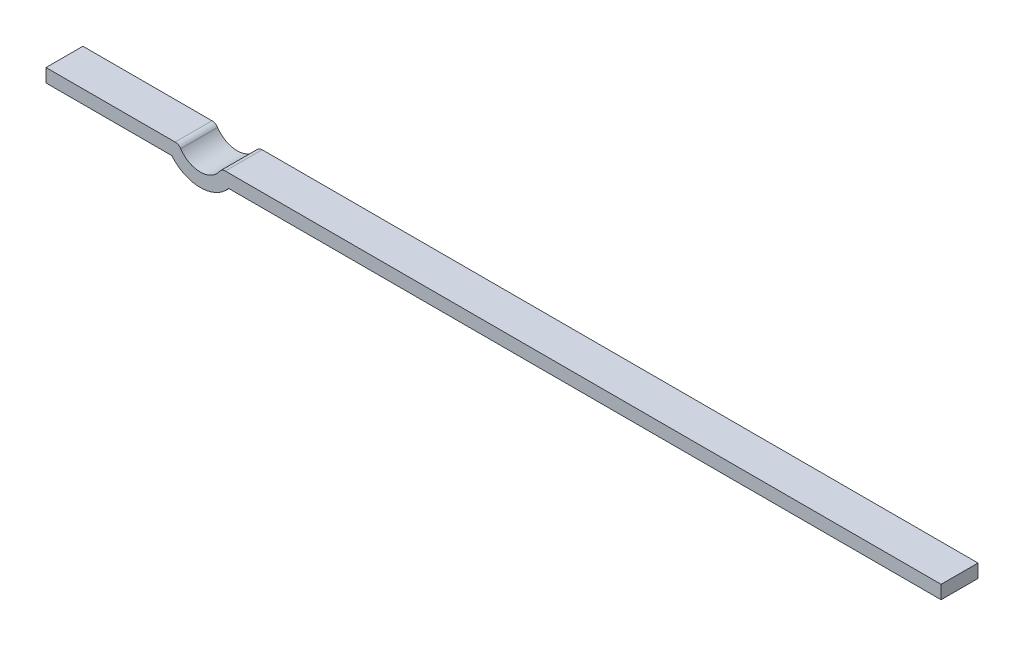
ISO-10303-21;
HEADER;
FILE_DESCRIPTION(('STEP AP214'),'2;1');
FILE_NAME('part.step','',(''),(''),'','','');
FILE_SCHEMA(('AUTOMOTIVE_DESIGN { 1 0 10303 214 1 1 1 1 }'));
ENDSEC;
DATA;
#1=APPLICATION_CONTEXT('core data for automotive mechanical design processes');
#2=APPLICATION_PROTOCOL_DEFINITION('international standard','automotive_design',2000,#1);
#3=PRODUCT_CONTEXT('',#1,'mechanical');
#4=PRODUCT('Part','Part','',(#3));
#5=PRODUCT_RELATED_PRODUCT_CATEGORY('part','',(#4));
#6=PRODUCT_DEFINITION_FORMATION('','',#4);
#7=PRODUCT_DEFINITION_CONTEXT('part definition',#1,'design');
#8=PRODUCT_DEFINITION('design','',#6,#7);
#9=PRODUCT_DEFINITION_SHAPE('','',#8);
#10=(LENGTH_UNIT() NAMED_UNIT(*) SI_UNIT(.MILLI.,.METRE.));
#11=(NAMED_UNIT(*) PLANE_ANGLE_UNIT() SI_UNIT($,.RADIAN.));
#12=(NAMED_UNIT(*) SI_UNIT($,.STERADIAN.) SOLID_ANGLE_UNIT());
#13=UNCERTAINTY_MEASURE_WITH_UNIT(LENGTH_MEASURE(1.E-05),#10,'distance_accuracy_value','');
#14=(GEOMETRIC_REPRESENTATION_CONTEXT(3) GLOBAL_UNCERTAINTY_ASSIGNED_CONTEXT((#13)) GLOBAL_UNIT_ASSIGNED_CONTEXT((#10,
#11,#12)) REPRESENTATION_CONTEXT('',''));
#15=CARTESIAN_POINT('',(0.,0.,0.));
#16=DIRECTION('',(0.,0.,1.));
#17=DIRECTION('',(1.,0.,0.));
#18=AXIS2_PLACEMENT_3D('',#15,#16,#17);
#19=CARTESIAN_POINT('',(6.675,-0.1,0.55));
#20=DIRECTION('',(-1.,0.,0.));
#21=DIRECTION('',(0.,0.,1.));
#22=AXIS2_PLACEMENT_3D('',#19,#20,#21);
#23=PLANE('',#22);
#24=DIRECTION('',(0.,1.,0.));
#25=VECTOR('',#24,1.);
#26=CARTESIAN_POINT('',(6.675,-0.1,0.));
#27=LINE('',#26,#25);
#28=CARTESIAN_POINT('',(6.675,-0.1,0.));
#29=VERTEX_POINT('',#28);
#30=CARTESIAN_POINT('',(6.675,0.1,0.));
#31=VERTEX_POINT('',#30);
#32=EDGE_CURVE('E142',#29,#31,#27,.T.);
#33=ORIENTED_EDGE('',*,*,#32,.T.);
#34=DIRECTION('',(0.,0.,-1.));
#35=VECTOR('',#34,1.);
#36=CARTESIAN_POINT('',(6.675,0.1,0.55));
#37=LINE('',#36,#35);
#38=CARTESIAN_POINT('',(6.675,0.1,0.55));
#39=VERTEX_POINT('',#38);
#40=EDGE_CURVE('E11',#39,#31,#37,.T.);
#41=ORIENTED_EDGE('',*,*,#40,.F.);
#42=DIRECTION('',(0.,1.,0.));
#43=VECTOR('',#42,1.);
#44=CARTESIAN_POINT('',(6.675,-0.1,0.55));
#45=LINE('',#44,#43);
#46=CARTESIAN_POINT('',(6.675,-0.1,0.55));
#47=VERTEX_POINT('',#46);
#48=EDGE_CURVE('E160',#47,#39,#45,.T.);
#49=ORIENTED_EDGE('',*,*,#48,.F.);
#50=DIRECTION('',(0.,0.,-1.));
#51=VECTOR('',#50,1.);
#52=CARTESIAN_POINT('',(6.675,-0.1,0.55));
#53=LINE('',#52,#51);
#54=EDGE_CURVE('E138',#47,#29,#53,.T.);
#55=ORIENTED_EDGE('',*,*,#54,.T.);
#56=EDGE_LOOP('',(#33,#41,#49,#55));
#57=FACE_BOUND('',#56,.T.);
#58=ADVANCED_FACE('F34',(#57),#23,.F.);
#59=CARTESIAN_POINT('',(-4.00059565600384,0.1,0.55));
#60=DIRECTION('',(0.,-1.,0.));
#61=DIRECTION('',(1.,0.,0.));
#62=AXIS2_PLACEMENT_3D('',#59,#60,#61);
#63=PLANE('',#62);
#64=DIRECTION('',(-1.,0.,0.));
#65=VECTOR('',#64,1.);
#66=CARTESIAN_POINT('',(-4.00059565600384,0.1,0.));
#67=LINE('',#66,#65);
#68=CARTESIAN_POINT('',(-4.00059565600384,0.1,0.));
#69=VERTEX_POINT('',#68);
#70=EDGE_CURVE('E145',#31,#69,#67,.T.);
#71=ORIENTED_EDGE('',*,*,#70,.T.);
#72=DIRECTION('',(0.,0.,-1.));
#73=VECTOR('',#72,1.);
#74=CARTESIAN_POINT('',(-4.00059565600384,0.1,0.55));
#75=LINE('',#74,#73);
#76=CARTESIAN_POINT('',(-4.00059565600384,0.1,0.55));
#77=VERTEX_POINT('',#76);
#78=EDGE_CURVE('E42',#77,#69,#75,.T.);
#79=ORIENTED_EDGE('',*,*,#78,.F.);
#80=DIRECTION('',(-1.,0.,0.));
#81=VECTOR('',#80,1.);
#82=CARTESIAN_POINT('',(-4.00059565600384,0.1,0.55));
#83=LINE('',#82,#81);
#84=EDGE_CURVE('E99',#39,#77,#83,.T.);
#85=ORIENTED_EDGE('',*,*,#84,.F.);
#86=ORIENTED_EDGE('',*,*,#40,.T.);
#87=EDGE_LOOP('',(#71,#79,#85,#86));
#88=FACE_BOUND('',#87,.T.);
#89=ADVANCED_FACE('F209',(#88),#63,.F.);
#90=CARTESIAN_POINT('',(-4.00059565600384,0.,0.55));
#91=DIRECTION('',(0.,0.,-1.));
#92=DIRECTION('',(-1.,0.,0.));
#93=AXIS2_PLACEMENT_3D('',#90,#91,#92);
#94=CYLINDRICAL_SURFACE('',#93,0.1);
#95=CARTESIAN_POINT('',(-4.00059565600384,0.,0.));
#96=DIRECTION('',(0.,0.,1.));
#97=DIRECTION('',(-1.,0.,0.));
#98=AXIS2_PLACEMENT_3D('',#95,#96,#97);
#99=CIRCLE('',#98,0.1);
#100=CARTESIAN_POINT('',(-4.08374106578076,0.0555593451457745,0.));
#101=VERTEX_POINT('',#100);
#102=EDGE_CURVE('E147',#69,#101,#99,.T.);
#103=ORIENTED_EDGE('',*,*,#102,.T.);
#104=DIRECTION('',(0.,0.,-1.));
#105=VECTOR('',#104,1.);
#106=CARTESIAN_POINT('',(-4.08374106578076,0.0555593451457745,0.55));
#107=LINE('',#106,#105);
#108=CARTESIAN_POINT('',(-4.08374106578076,0.0555593451457745,0.55));
#109=VERTEX_POINT('',#108);
#110=EDGE_CURVE('E173',#109,#101,#107,.T.);
#111=ORIENTED_EDGE('',*,*,#110,.F.);
#112=CARTESIAN_POINT('',(-4.00059565600384,0.,0.55));
#113=DIRECTION('',(0.,0.,1.));
#114=DIRECTION('',(-1.,0.,0.));
#115=AXIS2_PLACEMENT_3D('',#112,#113,#114);
#116=CIRCLE('',#115,0.1);
#117=EDGE_CURVE('E181',#77,#109,#116,.T.);
#118=ORIENTED_EDGE('',*,*,#117,.F.);
#119=ORIENTED_EDGE('',*,*,#78,.T.);
#120=EDGE_LOOP('',(#103,#111,#118,#119));
#121=FACE_BOUND('',#120,.T.);
#122=ADVANCED_FACE('F179',(#121),#94,.T.);
#123=CARTESIAN_POINT('',(-4.37475,0.250017053155985,0.55));
#124=DIRECTION('',(0.,0.,-1.));
#125=DIRECTION('',(-1.,0.,0.));
#126=AXIS2_PLACEMENT_3D('',#123,#124,#125);
#127=CYLINDRICAL_SURFACE('',#126,0.35);
#128=CARTESIAN_POINT('',(-4.37475,0.250017053155985,0.));
#129=DIRECTION('',(0.,0.,-1.));
#130=DIRECTION('',(1.,0.,0.));
#131=AXIS2_PLACEMENT_3D('',#128,#129,#130);
#132=CIRCLE('',#131,0.35);
#133=CARTESIAN_POINT('',(-4.66575893421924,0.0555593451457747,0.));
#134=VERTEX_POINT('',#133);
#135=EDGE_CURVE('E149',#101,#134,#132,.T.);
#136=ORIENTED_EDGE('',*,*,#135,.T.);
#137=DIRECTION('',(0.,0.,-1.));
#138=VECTOR('',#137,1.);
#139=CARTESIAN_POINT('',(-4.66575893421924,0.0555593451457747,0.55));
#140=LINE('',#139,#138);
#141=CARTESIAN_POINT('',(-4.66575893421924,0.0555593451457747,0.55));
#142=VERTEX_POINT('',#141);
#143=EDGE_CURVE('E170',#142,#134,#140,.T.);
#144=ORIENTED_EDGE('',*,*,#143,.F.);
#145=CARTESIAN_POINT('',(-4.37475,0.250017053155985,0.55));
#146=DIRECTION('',(0.,0.,-1.));
#147=DIRECTION('',(1.,0.,0.));
#148=AXIS2_PLACEMENT_3D('',#145,#146,#147);
#149=CIRCLE('',#148,0.35);
#150=EDGE_CURVE('E199',#109,#142,#149,.T.);
#151=ORIENTED_EDGE('',*,*,#150,.F.);
#152=ORIENTED_EDGE('',*,*,#110,.T.);
#153=EDGE_LOOP('',(#136,#144,#151,#152));
#154=FACE_BOUND('',#153,.T.);
#155=ADVANCED_FACE('F190',(#154),#127,.F.);
#156=CARTESIAN_POINT('',(-4.74890434399616,0.,0.55));
#157=DIRECTION('',(0.,0.,-1.));
#158=DIRECTION('',(-1.,0.,0.));
#159=AXIS2_PLACEMENT_3D('',#156,#157,#158);
#160=CYLINDRICAL_SURFACE('',#159,0.1);
#161=CARTESIAN_POINT('',(-4.74890434399616,0.,0.));
#162=DIRECTION('',(0.,0.,1.));
#163=DIRECTION('',(1.,0.,0.));
#164=AXIS2_PLACEMENT_3D('',#161,#162,#163);
#165=CIRCLE('',#164,0.1);
#166=CARTESIAN_POINT('',(-4.74890434399616,0.1,0.));
#167=VERTEX_POINT('',#166);
#168=EDGE_CURVE('E151',#134,#167,#165,.T.);
#169=ORIENTED_EDGE('',*,*,#168,.T.);
#170=DIRECTION('',(0.,0.,-1.));
#171=VECTOR('',#170,1.);
#172=CARTESIAN_POINT('',(-4.74890434399616,0.1,0.55));
#173=LINE('',#172,#171);
#174=CARTESIAN_POINT('',(-4.74890434399616,0.1,0.55));
#175=VERTEX_POINT('',#174);
#176=EDGE_CURVE('E167',#175,#167,#173,.T.);
#177=ORIENTED_EDGE('',*,*,#176,.F.);
#178=CARTESIAN_POINT('',(-4.74890434399616,0.,0.55));
#179=DIRECTION('',(0.,0.,1.));
#180=DIRECTION('',(1.,0.,0.));
#181=AXIS2_PLACEMENT_3D('',#178,#179,#180);
#182=CIRCLE('',#181,0.1);
#183=EDGE_CURVE('E196',#142,#175,#182,.T.);
#184=ORIENTED_EDGE('',*,*,#183,.F.);
#185=ORIENTED_EDGE('',*,*,#143,.T.);
#186=EDGE_LOOP('',(#169,#177,#184,#185));
#187=FACE_BOUND('',#186,.T.);
#188=ADVANCED_FACE('F194',(#187),#160,.T.);
#189=CARTESIAN_POINT('',(-6.675,0.1,0.55));
#190=DIRECTION('',(0.,-1.,0.));
#191=DIRECTION('',(1.,0.,0.));
#192=AXIS2_PLACEMENT_3D('',#189,#190,#191);
#193=PLANE('',#192);
#194=DIRECTION('',(-1.,0.,0.));
#195=VECTOR('',#194,1.);
#196=CARTESIAN_POINT('',(-6.675,0.1,0.));
#197=LINE('',#196,#195);
#198=CARTESIAN_POINT('',(-6.675,0.1,0.));
#199=VERTEX_POINT('',#198);
#200=EDGE_CURVE('E153',#167,#199,#197,.T.);
#201=ORIENTED_EDGE('',*,*,#200,.T.);
#202=DIRECTION('',(0.,0.,-1.));
#203=VECTOR('',#202,1.);
#204=CARTESIAN_POINT('',(-6.675,0.1,0.55));
#205=LINE('',#204,#203);
#206=CARTESIAN_POINT('',(-6.675,0.1,0.55));
#207=VERTEX_POINT('',#206);
#208=EDGE_CURVE('E164',#207,#199,#205,.T.);
#209=ORIENTED_EDGE('',*,*,#208,.F.);
#210=DIRECTION('',(-1.,0.,0.));
#211=VECTOR('',#210,1.);
#212=CARTESIAN_POINT('',(-6.675,0.1,0.55));
#213=LINE('',#212,#211);
#214=EDGE_CURVE('E198',#175,#207,#213,.T.);
#215=ORIENTED_EDGE('',*,*,#214,.F.);
#216=ORIENTED_EDGE('',*,*,#176,.T.);
#217=EDGE_LOOP('',(#201,#209,#215,#216));
#218=FACE_BOUND('',#217,.T.);
#219=ADVANCED_FACE('F221',(#218),#193,.F.);
#220=CARTESIAN_POINT('',(-6.675,-0.1,0.55));
#221=DIRECTION('',(1.,0.,0.));
#222=DIRECTION('',(0.,0.,-1.));
#223=AXIS2_PLACEMENT_3D('',#220,#221,#222);
#224=PLANE('',#223);
#225=DIRECTION('',(0.,-1.,0.));
#226=VECTOR('',#225,1.);
#227=CARTESIAN_POINT('',(-6.675,-0.1,0.));
#228=LINE('',#227,#226);
#229=CARTESIAN_POINT('',(-6.675,-0.1,0.));
#230=VERTEX_POINT('',#229);
#231=EDGE_CURVE('E155',#199,#230,#228,.T.);
#232=ORIENTED_EDGE('',*,*,#231,.T.);
#233=DIRECTION('',(0.,0.,-1.));
#234=VECTOR('',#233,1.);
#235=CARTESIAN_POINT('',(-6.675,-0.1,0.55));
#236=LINE('',#235,#234);
#237=CARTESIAN_POINT('',(-6.675,-0.1,0.55));
#238=VERTEX_POINT('',#237);
#239=EDGE_CURVE('E133',#238,#230,#236,.T.);
#240=ORIENTED_EDGE('',*,*,#239,.F.);
#241=DIRECTION('',(0.,-1.,0.));
#242=VECTOR('',#241,1.);
#243=CARTESIAN_POINT('',(-6.675,-0.1,0.55));
#244=LINE('',#243,#242);
#245=EDGE_CURVE('E124',#207,#238,#244,.T.);
#246=ORIENTED_EDGE('',*,*,#245,.F.);
#247=ORIENTED_EDGE('',*,*,#208,.T.);
#248=EDGE_LOOP('',(#232,#240,#246,#247));
#249=FACE_BOUND('',#248,.T.);
#250=ADVANCED_FACE('F224',(#249),#224,.F.);
#251=CARTESIAN_POINT('',(-6.675,-0.1,0.55));
#252=DIRECTION('',(0.,1.,0.));
#253=DIRECTION('',(0.,0.,1.));
#254=AXIS2_PLACEMENT_3D('',#251,#252,#253);
#255=PLANE('',#254);
#256=DIRECTION('',(1.,0.,0.));
#257=VECTOR('',#256,1.);
#258=CARTESIAN_POINT('',(-6.675,-0.1,0.));
#259=LINE('',#258,#257);
#260=CARTESIAN_POINT('',(-4.799,-0.1,0.));
#261=VERTEX_POINT('',#260);
#262=EDGE_CURVE('E132',#230,#261,#259,.T.);
#263=ORIENTED_EDGE('',*,*,#262,.T.);
#264=DIRECTION('',(0.,0.,-1.));
#265=VECTOR('',#264,1.);
#266=CARTESIAN_POINT('',(-4.799,-0.1,0.55));
#267=LINE('',#266,#265);
#268=CARTESIAN_POINT('',(-4.799,-0.1,0.55));
#269=VERTEX_POINT('',#268);
#270=EDGE_CURVE('E129',#269,#261,#267,.T.);
#271=ORIENTED_EDGE('',*,*,#270,.F.);
#272=DIRECTION('',(1.,0.,0.));
#273=VECTOR('',#272,1.);
#274=CARTESIAN_POINT('',(-6.675,-0.1,0.55));
#275=LINE('',#274,#273);
#276=EDGE_CURVE('E118',#238,#269,#275,.T.);
#277=ORIENTED_EDGE('',*,*,#276,.F.);
#278=ORIENTED_EDGE('',*,*,#239,.T.);
#279=EDGE_LOOP('',(#263,#271,#277,#278));
#280=FACE_BOUND('',#279,.T.);
#281=ADVANCED_FACE('F130',(#280),#255,.F.);
#282=CARTESIAN_POINT('',(-4.37475,0.250017053155985,0.55));
#283=DIRECTION('',(0.,0.,-1.));
#284=DIRECTION('',(-1.,0.,0.));
#285=AXIS2_PLACEMENT_3D('',#282,#283,#284);
#286=CYLINDRICAL_SURFACE('',#285,0.55);
#287=CARTESIAN_POINT('',(-4.37475,0.250017053155985,0.));
#288=DIRECTION('',(0.,0.,1.));
#289=DIRECTION('',(-1.,0.,0.));
#290=AXIS2_PLACEMENT_3D('',#287,#288,#289);
#291=CIRCLE('',#290,0.55);
#292=CARTESIAN_POINT('',(-3.9505,-0.0999999999999999,0.));
#293=VERTEX_POINT('',#292);
#294=EDGE_CURVE('E85',#261,#293,#291,.T.);
#295=ORIENTED_EDGE('',*,*,#294,.T.);
#296=DIRECTION('',(0.,0.,-1.));
#297=VECTOR('',#296,1.);
#298=CARTESIAN_POINT('',(-3.9505,-0.0999999999999999,0.55));
#299=LINE('',#298,#297);
#300=CARTESIAN_POINT('',(-3.9505,-0.0999999999999999,0.55));
#301=VERTEX_POINT('',#300);
#302=EDGE_CURVE('E134',#301,#293,#299,.T.);
#303=ORIENTED_EDGE('',*,*,#302,.F.);
#304=CARTESIAN_POINT('',(-4.37475,0.250017053155985,0.55));
#305=DIRECTION('',(0.,0.,1.));
#306=DIRECTION('',(-1.,0.,0.));
#307=AXIS2_PLACEMENT_3D('',#304,#305,#306);
#308=CIRCLE('',#307,0.55);
#309=EDGE_CURVE('E122',#269,#301,#308,.T.);
#310=ORIENTED_EDGE('',*,*,#309,.F.);
#311=ORIENTED_EDGE('',*,*,#270,.T.);
#312=EDGE_LOOP('',(#295,#303,#310,#311));
#313=FACE_BOUND('',#312,.T.);
#314=ADVANCED_FACE('F136',(#313),#286,.T.);
#315=CARTESIAN_POINT('',(-3.9505,-0.1,0.55));
#316=DIRECTION('',(0.,1.,0.));
#317=DIRECTION('',(0.,0.,1.));
#318=AXIS2_PLACEMENT_3D('',#315,#316,#317);
#319=PLANE('',#318);
#320=DIRECTION('',(1.,0.,0.));
#321=VECTOR('',#320,1.);
#322=CARTESIAN_POINT('',(-3.9505,-0.1,0.));
#323=LINE('',#322,#321);
#324=EDGE_CURVE('E91',#293,#29,#323,.T.);
#325=ORIENTED_EDGE('',*,*,#324,.T.);
#326=ORIENTED_EDGE('',*,*,#54,.F.);
#327=DIRECTION('',(1.,0.,0.));
#328=VECTOR('',#327,1.);
#329=CARTESIAN_POINT('',(-3.9505,-0.1,0.55));
#330=LINE('',#329,#328);
#331=EDGE_CURVE('E50',#301,#47,#330,.T.);
#332=ORIENTED_EDGE('',*,*,#331,.F.);
#333=ORIENTED_EDGE('',*,*,#302,.T.);
#334=EDGE_LOOP('',(#325,#326,#332,#333));
#335=FACE_BOUND('',#334,.T.);
#336=ADVANCED_FACE('F233',(#335),#319,.F.);
#337=CARTESIAN_POINT('',(-4.00059565600384,0.,0.55));
#338=DIRECTION('',(0.,0.,-1.));
#339=DIRECTION('',(-1.,0.,0.));
#340=AXIS2_PLACEMENT_3D('',#337,#338,#339);
#341=PLANE('',#340);
#342=ORIENTED_EDGE('',*,*,#48,.T.);
#343=ORIENTED_EDGE('',*,*,#84,.T.);
#344=ORIENTED_EDGE('',*,*,#117,.T.);
#345=ORIENTED_EDGE('',*,*,#150,.T.);
#346=ORIENTED_EDGE('',*,*,#183,.T.);
#347=ORIENTED_EDGE('',*,*,#214,.T.);
#348=ORIENTED_EDGE('',*,*,#245,.T.);
#349=ORIENTED_EDGE('',*,*,#276,.T.);
#350=ORIENTED_EDGE('',*,*,#309,.T.);
#351=ORIENTED_EDGE('',*,*,#331,.T.);
#352=EDGE_LOOP('',(#342,#343,#344,#345,#346,#347,#348,#349,#350,#351));
#353=FACE_BOUND('',#352,.T.);
#354=ADVANCED_FACE('F120',(#353),#341,.F.);
#355=CARTESIAN_POINT('',(-4.00059565600384,0.,0.));
#356=DIRECTION('',(0.,0.,-1.));
#357=DIRECTION('',(-1.,0.,0.));
#358=AXIS2_PLACEMENT_3D('',#355,#356,#357);
#359=PLANE('',#358);
#360=ORIENTED_EDGE('',*,*,#32,.F.);
#361=ORIENTED_EDGE('',*,*,#324,.F.);
#362=ORIENTED_EDGE('',*,*,#294,.F.);
#363=ORIENTED_EDGE('',*,*,#262,.F.);
#364=ORIENTED_EDGE('',*,*,#231,.F.);
#365=ORIENTED_EDGE('',*,*,#200,.F.);
#366=ORIENTED_EDGE('',*,*,#168,.F.);
#367=ORIENTED_EDGE('',*,*,#135,.F.);
#368=ORIENTED_EDGE('',*,*,#102,.F.);
#369=ORIENTED_EDGE('',*,*,#70,.F.);
#370=EDGE_LOOP('',(#360,#361,#362,#363,#364,#365,#366,#367,#368,#369));
#371=FACE_BOUND('',#370,.T.);
#372=ADVANCED_FACE('F185',(#371),#359,.T.);
#373=CLOSED_SHELL('',(#58,#89,#122,#155,#188,#219,#250,#281,#314,#336,#354,#372));
#374=MANIFOLD_SOLID_BREP('B2',#373);
#375=ADVANCED_BREP_SHAPE_REPRESENTATION('',(#18,#374),#14);
#376=SHAPE_DEFINITION_REPRESENTATION(#9,#375);
ENDSEC;
END-ISO-10303-21;
